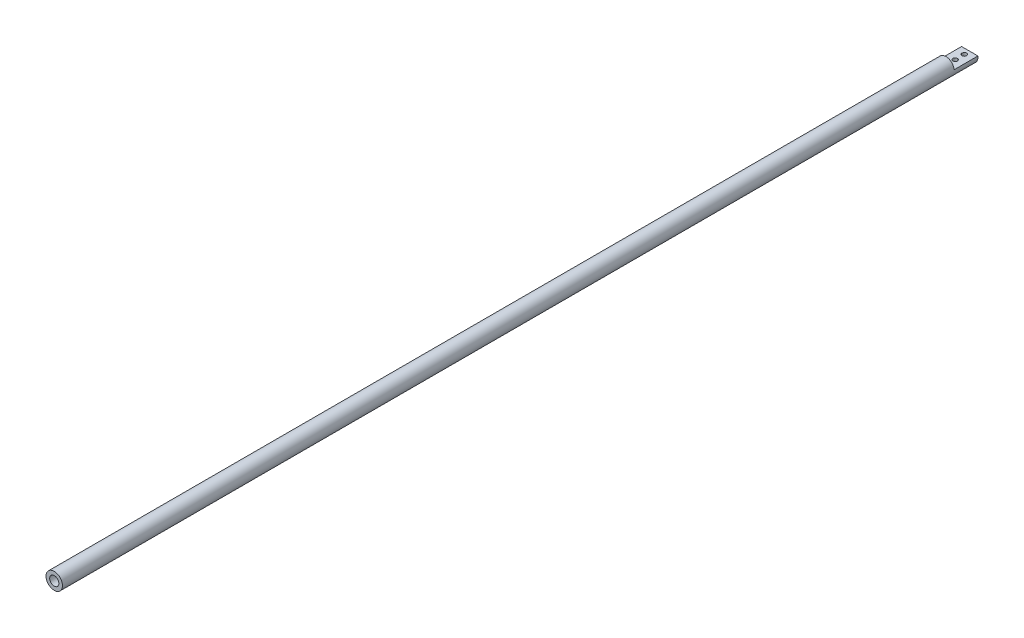
ISO-10303-21;
HEADER;
FILE_DESCRIPTION(('STEP AP214'),'2;1');
FILE_NAME('part.step','',(''),(''),'','','');
FILE_SCHEMA(('AUTOMOTIVE_DESIGN { 1 0 10303 214 1 1 1 1 }'));
ENDSEC;
DATA;
#1=APPLICATION_CONTEXT('core data for automotive mechanical design processes');
#2=APPLICATION_PROTOCOL_DEFINITION('international standard','automotive_design',2000,#1);
#3=PRODUCT_CONTEXT('',#1,'mechanical');
#4=PRODUCT('Part','Part','',(#3));
#5=PRODUCT_RELATED_PRODUCT_CATEGORY('part','',(#4));
#6=PRODUCT_DEFINITION_FORMATION('','',#4);
#7=PRODUCT_DEFINITION_CONTEXT('part definition',#1,'design');
#8=PRODUCT_DEFINITION('design','',#6,#7);
#9=PRODUCT_DEFINITION_SHAPE('','',#8);
#10=(LENGTH_UNIT() NAMED_UNIT(*) SI_UNIT(.MILLI.,.METRE.));
#11=(NAMED_UNIT(*) PLANE_ANGLE_UNIT() SI_UNIT($,.RADIAN.));
#12=(NAMED_UNIT(*) SI_UNIT($,.STERADIAN.) SOLID_ANGLE_UNIT());
#13=UNCERTAINTY_MEASURE_WITH_UNIT(LENGTH_MEASURE(1.E-05),#10,'distance_accuracy_value','');
#14=(GEOMETRIC_REPRESENTATION_CONTEXT(3) GLOBAL_UNCERTAINTY_ASSIGNED_CONTEXT((#13)) GLOBAL_UNIT_ASSIGNED_CONTEXT((#10,
#11,#12)) REPRESENTATION_CONTEXT('',''));
#15=CARTESIAN_POINT('',(0.,0.,0.));
#16=DIRECTION('',(0.,0.,1.));
#17=DIRECTION('',(1.,0.,0.));
#18=AXIS2_PLACEMENT_3D('',#15,#16,#17);
#19=CARTESIAN_POINT('',(0.,0.,1000.));
#20=DIRECTION('',(0.,0.,-1.));
#21=DIRECTION('',(-1.,0.,0.));
#22=AXIS2_PLACEMENT_3D('',#19,#20,#21);
#23=CYLINDRICAL_SURFACE('',#22,9.);
#24=CARTESIAN_POINT('',(0.,-9.,3.5));
#25=CARTESIAN_POINT('',(-0.137602501766359,-8.99999816033858,3.50000279917046));
#26=CARTESIAN_POINT('',(-0.275234247505334,-8.99681348173661,3.51139863961059));
#27=CARTESIAN_POINT('',(-0.546518951988477,-8.98441900396477,3.55659145653064));
#28=CARTESIAN_POINT('',(-0.680170207326879,-8.97520666298524,3.59039788342744));
#29=CARTESIAN_POINT('',(-0.939539899360603,-8.95177130789171,3.67921743882784));
#30=CARTESIAN_POINT('',(-1.06526878019134,-8.9375550606186,3.73420193739681));
#31=CARTESIAN_POINT('',(-1.30572139048355,-8.90560625164058,3.86370701265376));
#32=CARTESIAN_POINT('',(-1.42044414162461,-8.88787337777625,3.93822932383859));
#33=CARTESIAN_POINT('',(-1.63849356943184,-8.85030315634725,4.10665886768564));
#34=CARTESIAN_POINT('',(-1.74150622561691,-8.83042747246431,4.20096407937477));
#35=CARTESIAN_POINT('',(-1.93047637139272,-8.79105214235473,4.4054325542435));
#36=CARTESIAN_POINT('',(-2.01643146169124,-8.77155254937625,4.51559804455166));
#37=CARTESIAN_POINT('',(-2.17041617160631,-8.73474088585436,4.75121452025742));
#38=CARTESIAN_POINT('',(-2.23807749895613,-8.71747695878199,4.87691441688287));
#39=CARTESIAN_POINT('',(-2.35117914262341,-8.68765801630374,5.13846383528481));
#40=CARTESIAN_POINT('',(-2.39662394672714,-8.67510204999899,5.27431130083338));
#41=CARTESIAN_POINT('',(-2.46289848736025,-8.65651766235508,5.54880557770559));
#42=CARTESIAN_POINT('',(-2.48430073808206,-8.65033771821211,5.68730364324692));
#43=CARTESIAN_POINT('',(-2.50366854155516,-8.644752985852,5.96605177108539));
#44=CARTESIAN_POINT('',(-2.50163888054626,-8.64534681401298,6.10630146974488));
#45=CARTESIAN_POINT('',(-2.4746534267536,-8.65310733650123,6.38004455744811));
#46=CARTESIAN_POINT('',(-2.45039804541374,-8.66007321349828,6.51361360299315));
#47=CARTESIAN_POINT('',(-2.38077462403778,-8.67947034094293,6.77470725718247));
#48=CARTESIAN_POINT('',(-2.33540476914306,-8.6919020611927,6.90223134520431));
#49=CARTESIAN_POINT('',(-2.22428746268939,-8.72100139554956,7.14940446291076));
#50=CARTESIAN_POINT('',(-2.15830043673984,-8.7377183720132,7.26893973362016));
#51=CARTESIAN_POINT('',(-2.00798881359269,-8.77347901367673,7.49548315118243));
#52=CARTESIAN_POINT('',(-1.9236603325812,-8.79252317128379,7.60248863745226));
#53=CARTESIAN_POINT('',(-1.73551122056889,-8.83162144253916,7.80492776087285));
#54=CARTESIAN_POINT('',(-1.63110455940471,-8.85168740075652,7.89981526975971));
#55=CARTESIAN_POINT('',(-1.40761321440207,-8.88996399621587,8.07085146155562));
#56=CARTESIAN_POINT('',(-1.28852785084393,-8.90817454746904,8.14699927620496));
#57=CARTESIAN_POINT('',(-1.03816685867623,-8.94081679425529,8.27866363126015));
#58=CARTESIAN_POINT('',(-0.906832791495495,-8.95522897291068,8.33407420787781));
#59=CARTESIAN_POINT('',(-0.636219977539429,-8.97850985002887,8.42186819688273));
#60=CARTESIAN_POINT('',(-0.49694312824226,-8.98737986647399,8.45425708431313));
#61=CARTESIAN_POINT('',(-0.219053215426283,-8.99837472966817,8.49421427355795));
#62=CARTESIAN_POINT('',(-0.0805546117173621,-9.00070107648057,8.50252428981434));
#63=CARTESIAN_POINT('',(0.195859861273136,-8.99892960586322,8.49614600341514));
#64=CARTESIAN_POINT('',(0.333775794569041,-8.9948325135635,8.48146029670389));
#65=CARTESIAN_POINT('',(0.602413826941718,-8.98080530118042,8.43011333176074));
#66=CARTESIAN_POINT('',(0.733222576327722,-8.97098674335107,8.39387210988499));
#67=CARTESIAN_POINT('',(0.986886236237456,-8.94663658338763,8.30093626472377));
#68=CARTESIAN_POINT('',(1.10974024794481,-8.93210444977129,8.24423933486085));
#69=CARTESIAN_POINT('',(1.34684028081078,-8.89947480568143,8.11066824390714));
#70=CARTESIAN_POINT('',(1.4608541239069,-8.88130942680351,8.03339895135516));
#71=CARTESIAN_POINT('',(1.67455534117418,-8.84350954257204,7.86136772838458));
#72=CARTESIAN_POINT('',(1.77423962926343,-8.82387472213289,7.76660203986662));
#73=CARTESIAN_POINT('',(1.95962405388921,-8.78459685365757,7.55879711224522));
#74=CARTESIAN_POINT('',(2.04479915770501,-8.76497216404559,7.44528509689212));
#75=CARTESIAN_POINT('',(2.1949116285828,-8.72859386619894,7.20515872423328));
#76=CARTESIAN_POINT('',(2.25984976965914,-8.71184014816765,7.07854486828771));
#77=CARTESIAN_POINT('',(2.36716211667702,-8.68329597870045,6.81638566025139));
#78=CARTESIAN_POINT('',(2.40966154966511,-8.67147806034821,6.68089472457192));
#79=CARTESIAN_POINT('',(2.47115304987673,-8.65415753646738,6.40430058125616));
#80=CARTESIAN_POINT('',(2.49015175812551,-8.64865314684267,6.26319897076848));
#81=CARTESIAN_POINT('',(2.5036971994921,-8.64474076665062,5.98478844098643));
#82=CARTESIAN_POINT('',(2.49909142028599,-8.64608680814104,5.84752361993095));
#83=CARTESIAN_POINT('',(2.4675428657362,-8.65514273976249,5.57581021237917));
#84=CARTESIAN_POINT('',(2.4406007609873,-8.66285243883988,5.44136154145892));
#85=CARTESIAN_POINT('',(2.36565448497557,-8.68361437649823,5.18026553217672));
#86=CARTESIAN_POINT('',(2.31784429282322,-8.69661733835621,5.05355831470793));
#87=CARTESIAN_POINT('',(2.20266903341381,-8.72649832095034,4.80986515498191));
#88=CARTESIAN_POINT('',(2.13530066717352,-8.74337699532342,4.69288085702768));
#89=CARTESIAN_POINT('',(1.98041392404219,-8.77977621573303,4.46794469435062));
#90=CARTESIAN_POINT('',(1.8923241686926,-8.79936357965206,4.36039704663481));
#91=CARTESIAN_POINT('',(1.69956305490126,-8.83861663818042,4.16133525589282));
#92=CARTESIAN_POINT('',(1.59488759125636,-8.85828235100436,4.06982509421796));
#93=CARTESIAN_POINT('',(1.36892046461578,-8.89603679163285,3.90328372684391));
#94=CARTESIAN_POINT('',(1.24729251786435,-8.91407682385634,3.82869675337865));
#95=CARTESIAN_POINT('',(0.992723965385678,-8.94599949801159,3.70114372142103));
#96=CARTESIAN_POINT('',(0.859790060353448,-8.95988458070659,3.64816496283795));
#97=CARTESIAN_POINT('',(0.6062909675334,-8.98032149663911,3.57155983853061));
#98=CARTESIAN_POINT('',(0.486728804337481,-8.98764491323713,3.54479042481426));
#99=CARTESIAN_POINT('',(0.244785251386817,-8.99748469952567,3.50901030835491));
#100=CARTESIAN_POINT('',(0.122404196038829,-9.00000163646936,3.49999751000014));
#101=CARTESIAN_POINT('',(0.,-9.,3.5));
#102=B_SPLINE_CURVE_WITH_KNOTS('',3,(#24,#25,#26,#27,#28,#29,#30,#31,#32,#33,#34,#35,#36,#37,
#38,#39,#40,#41,#42,#43,#44,#45,#46,#47,#48,#49,#50,#51,#52,#53,#54,#55,#56,#57,#58,#59,#60,#61,
#62,#63,#64,#65,#66,#67,#68,#69,#70,#71,#72,#73,#74,#75,#76,#77,#78,#79,#80,#81,#82,#83,#84,#85,
#86,#87,#88,#89,#90,#91,#92,#93,#94,#95,#96,#97,#98,#99,#100,#101),.UNSPECIFIED.,.T.,.F.,(4,2,2,
2,2,2,2,2,2,2,2,2,2,2,2,2,2,2,2,2,2,2,2,2,2,2,2,2,2,2,2,2,2,2,2,2,2,2,4),(0.,0.412358386198981,
0.824890772294521,1.23686741588571,1.64888064567586,2.07015248650528,2.49148354087991,
2.92075380647343,3.34993732266768,3.76866863882698,4.18731442577046,4.593204659896,
4.99912978807063,5.40995920090068,5.82087569194106,6.2463898768508,6.67192377325048,
7.09960331280656,7.5271811070877,7.9414402118561,8.35565255505711,8.76204634963729,
9.16848598334834,9.58337897777209,9.99836119210685,10.4261198341446,10.8538621134516,
11.279191297197,11.7044002604958,12.114451985064,12.5244913992549,12.9307978713245,
13.3371729171665,13.7564382656794,14.1758075510164,14.6051618118986,15.0342633576383,
15.4011197307046,15.7679328052827),.UNSPECIFIED.);
#103=CARTESIAN_POINT('',(0.,-9.,3.5));
#104=VERTEX_POINT('',#103);
#105=EDGE_CURVE('E73',#104,#104,#102,.T.);
#106=ORIENTED_EDGE('',*,*,#105,.T.);
#107=EDGE_LOOP('',(#106));
#108=FACE_BOUND('',#107,.T.);
#109=CARTESIAN_POINT('',(0.,-9.,13.5));
#110=CARTESIAN_POINT('',(-0.137602501766359,-8.99999816033858,13.5000027991705));
#111=CARTESIAN_POINT('',(-0.275234247505335,-8.99681348173661,13.5113986396106));
#112=CARTESIAN_POINT('',(-0.546518951988477,-8.98441900396477,13.5565914565306));
#113=CARTESIAN_POINT('',(-0.680170207326879,-8.97520666298524,13.5903978834274));
#114=CARTESIAN_POINT('',(-0.939539899360602,-8.95177130789171,13.6792174388278));
#115=CARTESIAN_POINT('',(-1.06526878019134,-8.9375550606186,13.7342019373968));
#116=CARTESIAN_POINT('',(-1.30572139048355,-8.90560625164058,13.8637070126538));
#117=CARTESIAN_POINT('',(-1.42044414162461,-8.88787337777625,13.9382293238386));
#118=CARTESIAN_POINT('',(-1.63849356943184,-8.85030315634725,14.1066588676856));
#119=CARTESIAN_POINT('',(-1.7415062256169,-8.8304274724643,14.2009640793748));
#120=CARTESIAN_POINT('',(-1.93047637139272,-8.79105214235473,14.4054325542435));
#121=CARTESIAN_POINT('',(-2.01643146169124,-8.77155254937625,14.5155980445517));
#122=CARTESIAN_POINT('',(-2.17041617160631,-8.73474088585436,14.7512145202574));
#123=CARTESIAN_POINT('',(-2.23807749895613,-8.71747695878199,14.8769144168829));
#124=CARTESIAN_POINT('',(-2.35117914262341,-8.68765801630374,15.1384638352848));
#125=CARTESIAN_POINT('',(-2.39662394672714,-8.67510204999899,15.2743113008334));
#126=CARTESIAN_POINT('',(-2.46289848736025,-8.65651766235508,15.5488055777056));
#127=CARTESIAN_POINT('',(-2.48430073808206,-8.65033771821211,15.6873036432469));
#128=CARTESIAN_POINT('',(-2.50366854155516,-8.644752985852,15.9660517710854));
#129=CARTESIAN_POINT('',(-2.50163888054626,-8.64534681401298,16.1063014697449));
#130=CARTESIAN_POINT('',(-2.4746534267536,-8.65310733650123,16.3800445574481));
#131=CARTESIAN_POINT('',(-2.45039804541374,-8.66007321349828,16.5136136029932));
#132=CARTESIAN_POINT('',(-2.38077462403778,-8.67947034094293,16.7747072571825));
#133=CARTESIAN_POINT('',(-2.33540476914306,-8.6919020611927,16.9022313452043));
#134=CARTESIAN_POINT('',(-2.22428746268939,-8.72100139554956,17.1494044629108));
#135=CARTESIAN_POINT('',(-2.15830043673984,-8.7377183720132,17.2689397336202));
#136=CARTESIAN_POINT('',(-2.00798881359268,-8.77347901367673,17.4954831511824));
#137=CARTESIAN_POINT('',(-1.92366033258119,-8.79252317128379,17.6024886374523));
#138=CARTESIAN_POINT('',(-1.73551122056888,-8.83162144253916,17.8049277608729));
#139=CARTESIAN_POINT('',(-1.63110455940471,-8.85168740075652,17.8998152697597));
#140=CARTESIAN_POINT('',(-1.40761321440207,-8.88996399621587,18.0708514615556));
#141=CARTESIAN_POINT('',(-1.28852785084393,-8.90817454746904,18.146999276205));
#142=CARTESIAN_POINT('',(-1.03816685867623,-8.9408167942553,18.2786636312602));
#143=CARTESIAN_POINT('',(-0.906832791495493,-8.95522897291068,18.3340742078778));
#144=CARTESIAN_POINT('',(-0.636219977539427,-8.97850985002887,18.4218681968827));
#145=CARTESIAN_POINT('',(-0.496943128242258,-8.98737986647399,18.4542570843131));
#146=CARTESIAN_POINT('',(-0.219053215426282,-8.99837472966817,18.4942142735579));
#147=CARTESIAN_POINT('',(-0.0805546117173611,-9.00070107648057,18.5025242898143));
#148=CARTESIAN_POINT('',(0.195859861273137,-8.99892960586322,18.4961460034151));
#149=CARTESIAN_POINT('',(0.333775794569042,-8.9948325135635,18.4814602967039));
#150=CARTESIAN_POINT('',(0.602413826941718,-8.98080530118042,18.4301133317607));
#151=CARTESIAN_POINT('',(0.733222576327721,-8.97098674335107,18.393872109885));
#152=CARTESIAN_POINT('',(0.986886236237455,-8.94663658338763,18.3009362647238));
#153=CARTESIAN_POINT('',(1.10974024794481,-8.93210444977129,18.2442393348609));
#154=CARTESIAN_POINT('',(1.34684028081079,-8.89947480568143,18.1106682439071));
#155=CARTESIAN_POINT('',(1.4608541239069,-8.88130942680351,18.0333989513552));
#156=CARTESIAN_POINT('',(1.67455534117418,-8.84350954257204,17.8613677283846));
#157=CARTESIAN_POINT('',(1.77423962926343,-8.82387472213289,17.7666020398666));
#158=CARTESIAN_POINT('',(1.95962405388921,-8.78459685365757,17.5587971122452));
#159=CARTESIAN_POINT('',(2.04479915770501,-8.76497216404559,17.4452850968921));
#160=CARTESIAN_POINT('',(2.19491162858281,-8.72859386619894,17.2051587242333));
#161=CARTESIAN_POINT('',(2.25984976965914,-8.71184014816765,17.0785448682877));
#162=CARTESIAN_POINT('',(2.36716211667702,-8.68329597870045,16.8163856602514));
#163=CARTESIAN_POINT('',(2.40966154966511,-8.67147806034821,16.6808947245719));
#164=CARTESIAN_POINT('',(2.47115304987673,-8.65415753646738,16.4043005812562));
#165=CARTESIAN_POINT('',(2.49015175812551,-8.64865314684267,16.2631989707685));
#166=CARTESIAN_POINT('',(2.5036971994921,-8.64474076665062,15.9847884409864));
#167=CARTESIAN_POINT('',(2.49909142028599,-8.64608680814104,15.847523619931));
#168=CARTESIAN_POINT('',(2.4675428657362,-8.65514273976249,15.5758102123792));
#169=CARTESIAN_POINT('',(2.4406007609873,-8.66285243883988,15.4413615414589));
#170=CARTESIAN_POINT('',(2.36565448497557,-8.68361437649823,15.1802655321767));
#171=CARTESIAN_POINT('',(2.31784429282322,-8.69661733835621,15.0535583147079));
#172=CARTESIAN_POINT('',(2.20266903341381,-8.72649832095034,14.8098651549819));
#173=CARTESIAN_POINT('',(2.13530066717352,-8.74337699532342,14.6928808570277));
#174=CARTESIAN_POINT('',(1.98041392404219,-8.77977621573303,14.4679446943506));
#175=CARTESIAN_POINT('',(1.8923241686926,-8.79936357965206,14.3603970466348));
#176=CARTESIAN_POINT('',(1.69956305490126,-8.83861663818042,14.1613352558928));
#177=CARTESIAN_POINT('',(1.59488759125637,-8.85828235100436,14.069825094218));
#178=CARTESIAN_POINT('',(1.36892046461578,-8.89603679163285,13.9032837268439));
#179=CARTESIAN_POINT('',(1.24729251786435,-8.91407682385634,13.8286967533787));
#180=CARTESIAN_POINT('',(0.992723965385678,-8.94599949801159,13.701143721421));
#181=CARTESIAN_POINT('',(0.859790060353449,-8.95988458070659,13.648164962838));
#182=CARTESIAN_POINT('',(0.606290967533401,-8.98032149663911,13.5715598385306));
#183=CARTESIAN_POINT('',(0.486728804337481,-8.98764491323713,13.5447904248143));
#184=CARTESIAN_POINT('',(0.244785251386817,-8.99748469952567,13.5090103083549));
#185=CARTESIAN_POINT('',(0.12240419603883,-9.00000163646936,13.4999975100001));
#186=CARTESIAN_POINT('',(0.,-9.,13.5));
#187=B_SPLINE_CURVE_WITH_KNOTS('',3,(#109,#110,#111,#112,#113,#114,#115,#116,#117,#118,#119,
#120,#121,#122,#123,#124,#125,#126,#127,#128,#129,#130,#131,#132,#133,#134,#135,#136,#137,#138,
#139,#140,#141,#142,#143,#144,#145,#146,#147,#148,#149,#150,#151,#152,#153,#154,#155,#156,#157,
#158,#159,#160,#161,#162,#163,#164,#165,#166,#167,#168,#169,#170,#171,#172,#173,#174,#175,#176,
#177,#178,#179,#180,#181,#182,#183,#184,#185,#186),.UNSPECIFIED.,.T.,.F.,(4,2,2,2,2,2,2,2,2,2,2,
2,2,2,2,2,2,2,2,2,2,2,2,2,2,2,2,2,2,2,2,2,2,2,2,2,2,2,4),(0.,0.412358386198981,
0.824890772294522,1.23686741588571,1.64888064567586,2.07015248650528,2.49148354087991,
2.92075380647343,3.34993732266768,3.76866863882698,4.18731442577046,4.59320465989601,
4.99912978807063,5.40995920090069,5.82087569194107,6.2463898768508,6.67192377325049,
7.09960331280656,7.52718110708771,7.9414402118561,8.35565255505711,8.76204634963729,
9.16848598334834,9.58337897777209,9.99836119210685,10.4261198341446,10.8538621134516,
11.279191297197,11.7044002604958,12.114451985064,12.5244913992549,12.9307978713245,
13.3371729171665,13.7564382656794,14.1758075510164,14.6051618118986,15.0342633576383,
15.4011197307046,15.7679328052827),.UNSPECIFIED.);
#188=CARTESIAN_POINT('',(0.,-9.,13.5));
#189=VERTEX_POINT('',#188);
#190=EDGE_CURVE('E106',#189,#189,#187,.T.);
#191=ORIENTED_EDGE('',*,*,#190,.T.);
#192=EDGE_LOOP('',(#191));
#193=FACE_BOUND('',#192,.T.);
#194=CARTESIAN_POINT('',(0.,0.,1000.));
#195=DIRECTION('',(0.,0.,1.));
#196=DIRECTION('',(1.,0.,0.));
#197=AXIS2_PLACEMENT_3D('',#194,#195,#196);
#198=CIRCLE('',#197,9.);
#199=CARTESIAN_POINT('',(9.,0.,1000.));
#200=VERTEX_POINT('',#199);
#201=EDGE_CURVE('E11',#200,#200,#198,.T.);
#202=ORIENTED_EDGE('',*,*,#201,.F.);
#203=EDGE_LOOP('',(#202));
#204=FACE_BOUND('',#203,.T.);
#205=CARTESIAN_POINT('',(0.,0.,26.));
#206=DIRECTION('',(0.,0.,-1.));
#207=DIRECTION('',(-1.,0.,0.));
#208=AXIS2_PLACEMENT_3D('',#205,#206,#207);
#209=CIRCLE('',#208,9.);
#210=CARTESIAN_POINT('',(-8.94427190999916,0.999999999999998,26.));
#211=VERTEX_POINT('',#210);
#212=CARTESIAN_POINT('',(8.94427190999916,0.999999999999997,26.));
#213=VERTEX_POINT('',#212);
#214=EDGE_CURVE('E72',#211,#213,#209,.T.);
#215=ORIENTED_EDGE('',*,*,#214,.F.);
#216=DIRECTION('',(0.,0.,-1.));
#217=VECTOR('',#216,1.);
#218=CARTESIAN_POINT('',(-8.94427190999916,0.999999999999998,26.));
#219=LINE('',#218,#217);
#220=CARTESIAN_POINT('',(-8.94427190999916,0.999999999999998,0.));
#221=VERTEX_POINT('',#220);
#222=EDGE_CURVE('E61',#211,#221,#219,.T.);
#223=ORIENTED_EDGE('',*,*,#222,.T.);
#224=CARTESIAN_POINT('',(0.,0.,0.));
#225=DIRECTION('',(0.,0.,1.));
#226=DIRECTION('',(1.,0.,0.));
#227=AXIS2_PLACEMENT_3D('',#224,#225,#226);
#228=CIRCLE('',#227,9.);
#229=CARTESIAN_POINT('',(8.94427190999916,0.999999999999997,0.));
#230=VERTEX_POINT('',#229);
#231=EDGE_CURVE('E43',#221,#230,#228,.T.);
#232=ORIENTED_EDGE('',*,*,#231,.T.);
#233=DIRECTION('',(0.,0.,-1.));
#234=VECTOR('',#233,1.);
#235=CARTESIAN_POINT('',(8.94427190999916,0.999999999999997,26.));
#236=LINE('',#235,#234);
#237=EDGE_CURVE('E55',#213,#230,#236,.T.);
#238=ORIENTED_EDGE('',*,*,#237,.F.);
#239=EDGE_LOOP('',(#215,#223,#232,#238));
#240=FACE_BOUND('',#239,.T.);
#241=ADVANCED_FACE('F39',(#108,#193,#204,#240),#23,.T.);
#242=CARTESIAN_POINT('',(0.,0.,1000.));
#243=DIRECTION('',(0.,0.,1.));
#244=DIRECTION('',(1.,0.,0.));
#245=AXIS2_PLACEMENT_3D('',#242,#243,#244);
#246=PLANE('',#245);
#247=CARTESIAN_POINT('',(0.,0.,1000.));
#248=DIRECTION('',(0.,0.,1.));
#249=DIRECTION('',(1.,0.,0.));
#250=AXIS2_PLACEMENT_3D('',#247,#248,#249);
#251=CIRCLE('',#250,5.);
#252=CARTESIAN_POINT('',(5.,0.,1000.));
#253=VERTEX_POINT('',#252);
#254=EDGE_CURVE('E78',#253,#253,#251,.T.);
#255=ORIENTED_EDGE('',*,*,#254,.F.);
#256=EDGE_LOOP('',(#255));
#257=FACE_BOUND('',#256,.T.);
#258=ORIENTED_EDGE('',*,*,#201,.T.);
#259=EDGE_LOOP('',(#258));
#260=FACE_BOUND('',#259,.T.);
#261=ADVANCED_FACE('F135',(#257,#260),#246,.T.);
#262=CARTESIAN_POINT('',(0.,0.,0.));
#263=DIRECTION('',(0.,0.,1.));
#264=DIRECTION('',(1.,0.,0.));
#265=AXIS2_PLACEMENT_3D('',#262,#263,#264);
#266=PLANE('',#265);
#267=ORIENTED_EDGE('',*,*,#231,.F.);
#268=DIRECTION('',(-1.,0.,0.));
#269=VECTOR('',#268,1.);
#270=CARTESIAN_POINT('',(8.94427190999916,0.999999999999997,0.));
#271=LINE('',#270,#269);
#272=EDGE_CURVE('E66',#230,#221,#271,.T.);
#273=ORIENTED_EDGE('',*,*,#272,.F.);
#274=EDGE_LOOP('',(#267,#273));
#275=FACE_BOUND('',#274,.T.);
#276=ADVANCED_FACE('F80',(#275),#266,.F.);
#277=CARTESIAN_POINT('',(0.,0.,970.));
#278=DIRECTION('',(0.,0.,1.));
#279=DIRECTION('',(1.,0.,0.));
#280=AXIS2_PLACEMENT_3D('',#277,#278,#279);
#281=CYLINDRICAL_SURFACE('',#280,5.);
#282=CARTESIAN_POINT('',(0.,0.,970.));
#283=DIRECTION('',(0.,0.,1.));
#284=DIRECTION('',(1.,0.,0.));
#285=AXIS2_PLACEMENT_3D('',#282,#283,#284);
#286=CIRCLE('',#285,5.);
#287=CARTESIAN_POINT('',(5.,0.,970.));
#288=VERTEX_POINT('',#287);
#289=EDGE_CURVE('E82',#288,#288,#286,.T.);
#290=ORIENTED_EDGE('',*,*,#289,.F.);
#291=EDGE_LOOP('',(#290));
#292=FACE_BOUND('',#291,.T.);
#293=ORIENTED_EDGE('',*,*,#254,.T.);
#294=EDGE_LOOP('',(#293));
#295=FACE_BOUND('',#294,.T.);
#296=ADVANCED_FACE('F131',(#292,#295),#281,.F.);
#297=CARTESIAN_POINT('',(0.,0.,970.));
#298=DIRECTION('',(0.,0.,1.));
#299=DIRECTION('',(1.,0.,0.));
#300=AXIS2_PLACEMENT_3D('',#297,#298,#299);
#301=PLANE('',#300);
#302=ORIENTED_EDGE('',*,*,#289,.T.);
#303=EDGE_LOOP('',(#302));
#304=FACE_BOUND('',#303,.T.);
#305=ADVANCED_FACE('F127',(#304),#301,.T.);
#306=CARTESIAN_POINT('',(8.94427190999916,0.999999999999997,26.));
#307=DIRECTION('',(0.,-1.,0.));
#308=DIRECTION('',(1.,0.,0.));
#309=AXIS2_PLACEMENT_3D('',#306,#307,#308);
#310=PLANE('',#309);
#311=CARTESIAN_POINT('',(0.,0.999999999999998,6.));
#312=DIRECTION('',(0.,1.,0.));
#313=DIRECTION('',(-1.,0.,0.));
#314=AXIS2_PLACEMENT_3D('',#311,#312,#313);
#315=CIRCLE('',#314,2.5);
#316=CARTESIAN_POINT('',(-2.5,0.999999999999998,6.));
#317=VERTEX_POINT('',#316);
#318=EDGE_CURVE('E154',#317,#317,#315,.T.);
#319=ORIENTED_EDGE('',*,*,#318,.F.);
#320=EDGE_LOOP('',(#319));
#321=FACE_BOUND('',#320,.T.);
#322=CARTESIAN_POINT('',(0.,0.999999999999998,16.));
#323=DIRECTION('',(0.,1.,0.));
#324=DIRECTION('',(-1.,0.,0.));
#325=AXIS2_PLACEMENT_3D('',#322,#323,#324);
#326=CIRCLE('',#325,2.5);
#327=CARTESIAN_POINT('',(-2.5,0.999999999999998,16.));
#328=VERTEX_POINT('',#327);
#329=EDGE_CURVE('E157',#328,#328,#326,.T.);
#330=ORIENTED_EDGE('',*,*,#329,.F.);
#331=EDGE_LOOP('',(#330));
#332=FACE_BOUND('',#331,.T.);
#333=ORIENTED_EDGE('',*,*,#272,.T.);
#334=ORIENTED_EDGE('',*,*,#222,.F.);
#335=DIRECTION('',(-1.,0.,0.));
#336=VECTOR('',#335,1.);
#337=CARTESIAN_POINT('',(8.94427190999916,0.999999999999997,26.));
#338=LINE('',#337,#336);
#339=EDGE_CURVE('E93',#213,#211,#338,.T.);
#340=ORIENTED_EDGE('',*,*,#339,.F.);
#341=ORIENTED_EDGE('',*,*,#237,.T.);
#342=EDGE_LOOP('',(#333,#334,#340,#341));
#343=FACE_BOUND('',#342,.T.);
#344=ADVANCED_FACE('F67',(#321,#332,#343),#310,.F.);
#345=CARTESIAN_POINT('',(0.,0.,26.));
#346=DIRECTION('',(0.,0.,-1.));
#347=DIRECTION('',(-1.,0.,0.));
#348=AXIS2_PLACEMENT_3D('',#345,#346,#347);
#349=PLANE('',#348);
#350=ORIENTED_EDGE('',*,*,#214,.T.);
#351=ORIENTED_EDGE('',*,*,#339,.T.);
#352=EDGE_LOOP('',(#350,#351));
#353=FACE_BOUND('',#352,.T.);
#354=ADVANCED_FACE('F120',(#353),#349,.T.);
#355=CARTESIAN_POINT('',(0.,-9.,16.));
#356=DIRECTION('',(0.,1.,0.));
#357=DIRECTION('',(-1.,0.,0.));
#358=AXIS2_PLACEMENT_3D('',#355,#356,#357);
#359=CYLINDRICAL_SURFACE('',#358,2.5);
#360=ORIENTED_EDGE('',*,*,#329,.T.);
#361=EDGE_LOOP('',(#360));
#362=FACE_BOUND('',#361,.T.);
#363=ORIENTED_EDGE('',*,*,#190,.F.);
#364=EDGE_LOOP('',(#363));
#365=FACE_BOUND('',#364,.T.);
#366=ADVANCED_FACE('F115',(#362,#365),#359,.F.);
#367=CARTESIAN_POINT('',(0.,-9.,6.));
#368=DIRECTION('',(0.,1.,0.));
#369=DIRECTION('',(-1.,0.,0.));
#370=AXIS2_PLACEMENT_3D('',#367,#368,#369);
#371=CYLINDRICAL_SURFACE('',#370,2.5);
#372=ORIENTED_EDGE('',*,*,#318,.T.);
#373=EDGE_LOOP('',(#372));
#374=FACE_BOUND('',#373,.T.);
#375=ORIENTED_EDGE('',*,*,#105,.F.);
#376=EDGE_LOOP('',(#375));
#377=FACE_BOUND('',#376,.T.);
#378=ADVANCED_FACE('F112',(#374,#377),#371,.F.);
#379=CLOSED_SHELL('',(#241,#261,#276,#296,#305,#344,#354,#366,#378));
#380=MANIFOLD_SOLID_BREP('B2',#379);
#381=ADVANCED_BREP_SHAPE_REPRESENTATION('',(#18,#380),#14);
#382=SHAPE_DEFINITION_REPRESENTATION(#9,#381);
ENDSEC;
END-ISO-10303-21;
